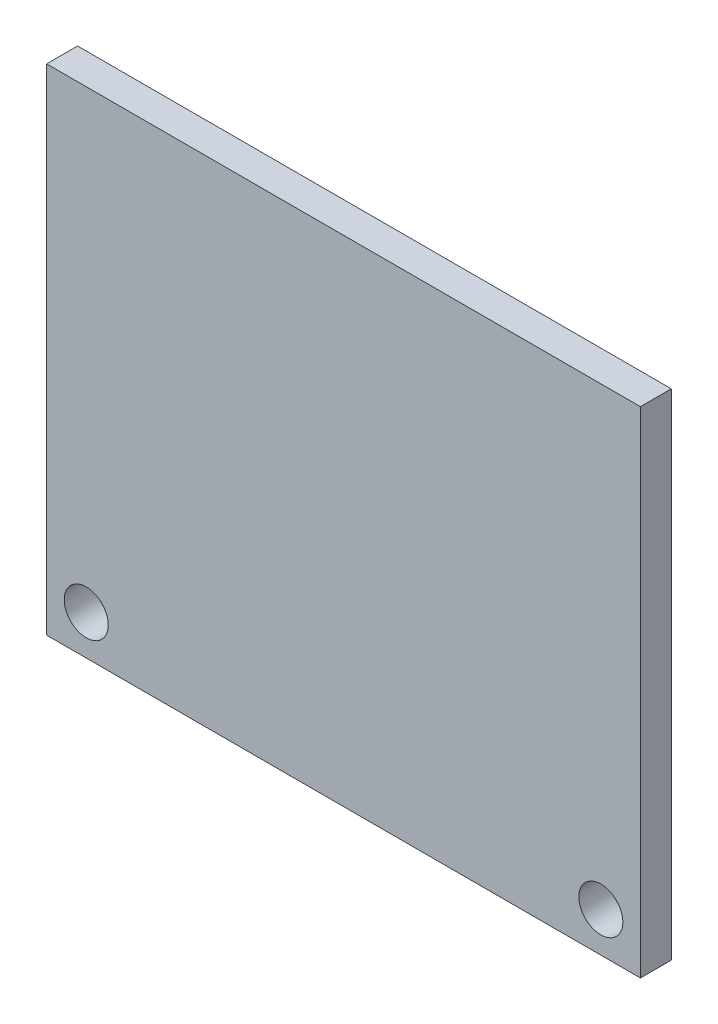
ISO-10303-21;
HEADER;
FILE_DESCRIPTION(('STEP AP214'),'2;1');
FILE_NAME('part.step','',(''),(''),'','','');
FILE_SCHEMA(('AUTOMOTIVE_DESIGN { 1 0 10303 214 1 1 1 1 }'));
ENDSEC;
DATA;
#1=APPLICATION_CONTEXT('core data for automotive mechanical design processes');
#2=APPLICATION_PROTOCOL_DEFINITION('international standard','automotive_design',2000,#1);
#3=PRODUCT_CONTEXT('',#1,'mechanical');
#4=PRODUCT('Part','Part','',(#3));
#5=PRODUCT_RELATED_PRODUCT_CATEGORY('part','',(#4));
#6=PRODUCT_DEFINITION_FORMATION('','',#4);
#7=PRODUCT_DEFINITION_CONTEXT('part definition',#1,'design');
#8=PRODUCT_DEFINITION('design','',#6,#7);
#9=PRODUCT_DEFINITION_SHAPE('','',#8);
#10=(LENGTH_UNIT() NAMED_UNIT(*) SI_UNIT(.MILLI.,.METRE.));
#11=(NAMED_UNIT(*) PLANE_ANGLE_UNIT() SI_UNIT($,.RADIAN.));
#12=(NAMED_UNIT(*) SI_UNIT($,.STERADIAN.) SOLID_ANGLE_UNIT());
#13=UNCERTAINTY_MEASURE_WITH_UNIT(LENGTH_MEASURE(1.E-05),#10,'distance_accuracy_value','');
#14=(GEOMETRIC_REPRESENTATION_CONTEXT(3) GLOBAL_UNCERTAINTY_ASSIGNED_CONTEXT((#13)) GLOBAL_UNIT_ASSIGNED_CONTEXT((#10,
#11,#12)) REPRESENTATION_CONTEXT('',''));
#15=CARTESIAN_POINT('',(0.,0.,0.));
#16=DIRECTION('',(0.,0.,1.));
#17=DIRECTION('',(1.,0.,0.));
#18=AXIS2_PLACEMENT_3D('',#15,#16,#17);
#19=CARTESIAN_POINT('',(15.24,12.7,-1.5875));
#20=DIRECTION('',(-1.,0.,0.));
#21=DIRECTION('',(0.,-1.,0.));
#22=AXIS2_PLACEMENT_3D('',#19,#20,#21);
#23=PLANE('',#22);
#24=DIRECTION('',(0.,1.,0.));
#25=VECTOR('',#24,1.);
#26=CARTESIAN_POINT('',(15.24,12.7,0.));
#27=LINE('',#26,#25);
#28=CARTESIAN_POINT('',(15.24,-12.7,0.));
#29=VERTEX_POINT('',#28);
#30=CARTESIAN_POINT('',(15.24,12.7,0.));
#31=VERTEX_POINT('',#30);
#32=EDGE_CURVE('E96',#29,#31,#27,.T.);
#33=ORIENTED_EDGE('',*,*,#32,.F.);
#34=DIRECTION('',(0.,0.,1.));
#35=VECTOR('',#34,1.);
#36=CARTESIAN_POINT('',(15.24,-12.7,-1.5875));
#37=LINE('',#36,#35);
#38=CARTESIAN_POINT('',(15.24,-12.7,-1.5875));
#39=VERTEX_POINT('',#38);
#40=EDGE_CURVE('E95',#39,#29,#37,.T.);
#41=ORIENTED_EDGE('',*,*,#40,.F.);
#42=DIRECTION('',(0.,1.,0.));
#43=VECTOR('',#42,1.);
#44=CARTESIAN_POINT('',(15.24,12.7,-1.5875));
#45=LINE('',#44,#43);
#46=CARTESIAN_POINT('',(15.24,12.7,-1.5875));
#47=VERTEX_POINT('',#46);
#48=EDGE_CURVE('E89',#39,#47,#45,.T.);
#49=ORIENTED_EDGE('',*,*,#48,.T.);
#50=DIRECTION('',(0.,0.,1.));
#51=VECTOR('',#50,1.);
#52=CARTESIAN_POINT('',(15.24,12.7,-1.5875));
#53=LINE('',#52,#51);
#54=EDGE_CURVE('E11',#47,#31,#53,.T.);
#55=ORIENTED_EDGE('',*,*,#54,.T.);
#56=EDGE_LOOP('',(#33,#41,#49,#55));
#57=FACE_BOUND('',#56,.T.);
#58=ADVANCED_FACE('F32',(#57),#23,.F.);
#59=CARTESIAN_POINT('',(-15.24,12.7,-1.5875));
#60=DIRECTION('',(0.,-1.,0.));
#61=DIRECTION('',(0.,0.,1.));
#62=AXIS2_PLACEMENT_3D('',#59,#60,#61);
#63=PLANE('',#62);
#64=DIRECTION('',(-1.,0.,0.));
#65=VECTOR('',#64,1.);
#66=CARTESIAN_POINT('',(-15.24,12.7,0.));
#67=LINE('',#66,#65);
#68=CARTESIAN_POINT('',(-15.24,12.7,0.));
#69=VERTEX_POINT('',#68);
#70=EDGE_CURVE('E98',#31,#69,#67,.T.);
#71=ORIENTED_EDGE('',*,*,#70,.F.);
#72=ORIENTED_EDGE('',*,*,#54,.F.);
#73=DIRECTION('',(-1.,0.,0.));
#74=VECTOR('',#73,1.);
#75=CARTESIAN_POINT('',(-15.24,12.7,-1.5875));
#76=LINE('',#75,#74);
#77=CARTESIAN_POINT('',(-15.24,12.7,-1.5875));
#78=VERTEX_POINT('',#77);
#79=EDGE_CURVE('E73',#47,#78,#76,.T.);
#80=ORIENTED_EDGE('',*,*,#79,.T.);
#81=DIRECTION('',(0.,0.,1.));
#82=VECTOR('',#81,1.);
#83=CARTESIAN_POINT('',(-15.24,12.7,-1.5875));
#84=LINE('',#83,#82);
#85=EDGE_CURVE('E40',#78,#69,#84,.T.);
#86=ORIENTED_EDGE('',*,*,#85,.T.);
#87=EDGE_LOOP('',(#71,#72,#80,#86));
#88=FACE_BOUND('',#87,.T.);
#89=ADVANCED_FACE('F87',(#88),#63,.F.);
#90=CARTESIAN_POINT('',(-15.24,12.7,-1.5875));
#91=DIRECTION('',(1.,0.,0.));
#92=DIRECTION('',(0.,1.,0.));
#93=AXIS2_PLACEMENT_3D('',#90,#91,#92);
#94=PLANE('',#93);
#95=DIRECTION('',(0.,-1.,0.));
#96=VECTOR('',#95,1.);
#97=CARTESIAN_POINT('',(-15.24,12.7,0.));
#98=LINE('',#97,#96);
#99=CARTESIAN_POINT('',(-15.24,-12.7,0.));
#100=VERTEX_POINT('',#99);
#101=EDGE_CURVE('E83',#69,#100,#98,.T.);
#102=ORIENTED_EDGE('',*,*,#101,.F.);
#103=ORIENTED_EDGE('',*,*,#85,.F.);
#104=DIRECTION('',(0.,-1.,0.));
#105=VECTOR('',#104,1.);
#106=CARTESIAN_POINT('',(-15.24,12.7,-1.5875));
#107=LINE('',#106,#105);
#108=CARTESIAN_POINT('',(-15.24,-12.7,-1.5875));
#109=VERTEX_POINT('',#108);
#110=EDGE_CURVE('E76',#78,#109,#107,.T.);
#111=ORIENTED_EDGE('',*,*,#110,.T.);
#112=DIRECTION('',(0.,0.,1.));
#113=VECTOR('',#112,1.);
#114=CARTESIAN_POINT('',(-15.24,-12.7,-1.5875));
#115=LINE('',#114,#113);
#116=EDGE_CURVE('E86',#109,#100,#115,.T.);
#117=ORIENTED_EDGE('',*,*,#116,.T.);
#118=EDGE_LOOP('',(#102,#103,#111,#117));
#119=FACE_BOUND('',#118,.T.);
#120=ADVANCED_FACE('F82',(#119),#94,.F.);
#121=CARTESIAN_POINT('',(-15.24,-12.7,-1.5875));
#122=DIRECTION('',(0.,1.,0.));
#123=DIRECTION('',(0.,0.,-1.));
#124=AXIS2_PLACEMENT_3D('',#121,#122,#123);
#125=PLANE('',#124);
#126=DIRECTION('',(1.,0.,0.));
#127=VECTOR('',#126,1.);
#128=CARTESIAN_POINT('',(-15.24,-12.7,0.));
#129=LINE('',#128,#127);
#130=EDGE_CURVE('E62',#100,#29,#129,.T.);
#131=ORIENTED_EDGE('',*,*,#130,.F.);
#132=ORIENTED_EDGE('',*,*,#116,.F.);
#133=DIRECTION('',(1.,0.,0.));
#134=VECTOR('',#133,1.);
#135=CARTESIAN_POINT('',(-15.24,-12.7,-1.5875));
#136=LINE('',#135,#134);
#137=EDGE_CURVE('E48',#109,#39,#136,.T.);
#138=ORIENTED_EDGE('',*,*,#137,.T.);
#139=ORIENTED_EDGE('',*,*,#40,.T.);
#140=EDGE_LOOP('',(#131,#132,#138,#139));
#141=FACE_BOUND('',#140,.T.);
#142=ADVANCED_FACE('F108',(#141),#125,.F.);
#143=CARTESIAN_POINT('',(15.24,-12.7,-1.5875));
#144=DIRECTION('',(0.,0.,-1.));
#145=DIRECTION('',(1.,0.,0.));
#146=AXIS2_PLACEMENT_3D('',#143,#144,#145);
#147=PLANE('',#146);
#148=CARTESIAN_POINT('',(13.208,-10.668,-1.5875));
#149=DIRECTION('',(0.,0.,1.));
#150=DIRECTION('',(1.,0.,0.));
#151=AXIS2_PLACEMENT_3D('',#148,#149,#150);
#152=CIRCLE('',#151,1.13029999999999);
#153=CARTESIAN_POINT('',(14.3383,-10.668,-1.5875));
#154=VERTEX_POINT('',#153);
#155=EDGE_CURVE('E177',#154,#154,#152,.T.);
#156=ORIENTED_EDGE('',*,*,#155,.T.);
#157=EDGE_LOOP('',(#156));
#158=FACE_BOUND('',#157,.T.);
#159=CARTESIAN_POINT('',(-13.208,-10.668,-1.5875));
#160=DIRECTION('',(0.,0.,1.));
#161=DIRECTION('',(1.,0.,0.));
#162=AXIS2_PLACEMENT_3D('',#159,#160,#161);
#163=CIRCLE('',#162,1.13029999999999);
#164=CARTESIAN_POINT('',(-12.0777,-10.668,-1.5875));
#165=VERTEX_POINT('',#164);
#166=EDGE_CURVE('E179',#165,#165,#163,.T.);
#167=ORIENTED_EDGE('',*,*,#166,.T.);
#168=EDGE_LOOP('',(#167));
#169=FACE_BOUND('',#168,.T.);
#170=ORIENTED_EDGE('',*,*,#48,.F.);
#171=ORIENTED_EDGE('',*,*,#137,.F.);
#172=ORIENTED_EDGE('',*,*,#110,.F.);
#173=ORIENTED_EDGE('',*,*,#79,.F.);
#174=EDGE_LOOP('',(#170,#171,#172,#173));
#175=FACE_BOUND('',#174,.T.);
#176=ADVANCED_FACE('F78',(#158,#169,#175),#147,.T.);
#177=CARTESIAN_POINT('',(15.24,-12.7,0.));
#178=DIRECTION('',(0.,0.,-1.));
#179=DIRECTION('',(1.,0.,0.));
#180=AXIS2_PLACEMENT_3D('',#177,#178,#179);
#181=PLANE('',#180);
#182=CARTESIAN_POINT('',(13.208,-10.668,0.));
#183=DIRECTION('',(0.,0.,1.));
#184=DIRECTION('',(1.,0.,0.));
#185=AXIS2_PLACEMENT_3D('',#182,#183,#184);
#186=CIRCLE('',#185,1.13029999999999);
#187=CARTESIAN_POINT('',(14.3383,-10.668,0.));
#188=VERTEX_POINT('',#187);
#189=EDGE_CURVE('E174',#188,#188,#186,.T.);
#190=ORIENTED_EDGE('',*,*,#189,.F.);
#191=EDGE_LOOP('',(#190));
#192=FACE_BOUND('',#191,.T.);
#193=CARTESIAN_POINT('',(-13.208,-10.668,0.));
#194=DIRECTION('',(0.,0.,1.));
#195=DIRECTION('',(1.,0.,0.));
#196=AXIS2_PLACEMENT_3D('',#193,#194,#195);
#197=CIRCLE('',#196,1.13029999999999);
#198=CARTESIAN_POINT('',(-12.0777,-10.668,0.));
#199=VERTEX_POINT('',#198);
#200=EDGE_CURVE('E99',#199,#199,#197,.T.);
#201=ORIENTED_EDGE('',*,*,#200,.F.);
#202=EDGE_LOOP('',(#201));
#203=FACE_BOUND('',#202,.T.);
#204=ORIENTED_EDGE('',*,*,#32,.T.);
#205=ORIENTED_EDGE('',*,*,#70,.T.);
#206=ORIENTED_EDGE('',*,*,#101,.T.);
#207=ORIENTED_EDGE('',*,*,#130,.T.);
#208=EDGE_LOOP('',(#204,#205,#206,#207));
#209=FACE_BOUND('',#208,.T.);
#210=ADVANCED_FACE('F104',(#192,#203,#209),#181,.F.);
#211=CARTESIAN_POINT('',(-13.208,-10.668,-1.5875));
#212=DIRECTION('',(0.,0.,-1.));
#213=DIRECTION('',(1.,0.,0.));
#214=AXIS2_PLACEMENT_3D('',#211,#212,#213);
#215=CYLINDRICAL_SURFACE('',#214,1.13029999999999);
#216=ORIENTED_EDGE('',*,*,#200,.T.);
#217=EDGE_LOOP('',(#216));
#218=FACE_BOUND('',#217,.T.);
#219=ORIENTED_EDGE('',*,*,#166,.F.);
#220=EDGE_LOOP('',(#219));
#221=FACE_BOUND('',#220,.T.);
#222=ADVANCED_FACE('F148',(#218,#221),#215,.F.);
#223=CARTESIAN_POINT('',(13.208,-10.668,-1.5875));
#224=DIRECTION('',(0.,0.,-1.));
#225=DIRECTION('',(1.,0.,0.));
#226=AXIS2_PLACEMENT_3D('',#223,#224,#225);
#227=CYLINDRICAL_SURFACE('',#226,1.13029999999999);
#228=ORIENTED_EDGE('',*,*,#189,.T.);
#229=EDGE_LOOP('',(#228));
#230=FACE_BOUND('',#229,.T.);
#231=ORIENTED_EDGE('',*,*,#155,.F.);
#232=EDGE_LOOP('',(#231));
#233=FACE_BOUND('',#232,.T.);
#234=ADVANCED_FACE('F157',(#230,#233),#227,.F.);
#235=CLOSED_SHELL('',(#58,#89,#120,#142,#176,#210,#222,#234));
#236=MANIFOLD_SOLID_BREP('B2',#235);
#237=ADVANCED_BREP_SHAPE_REPRESENTATION('',(#18,#236),#14);
#238=SHAPE_DEFINITION_REPRESENTATION(#9,#237);
ENDSEC;
END-ISO-10303-21;
